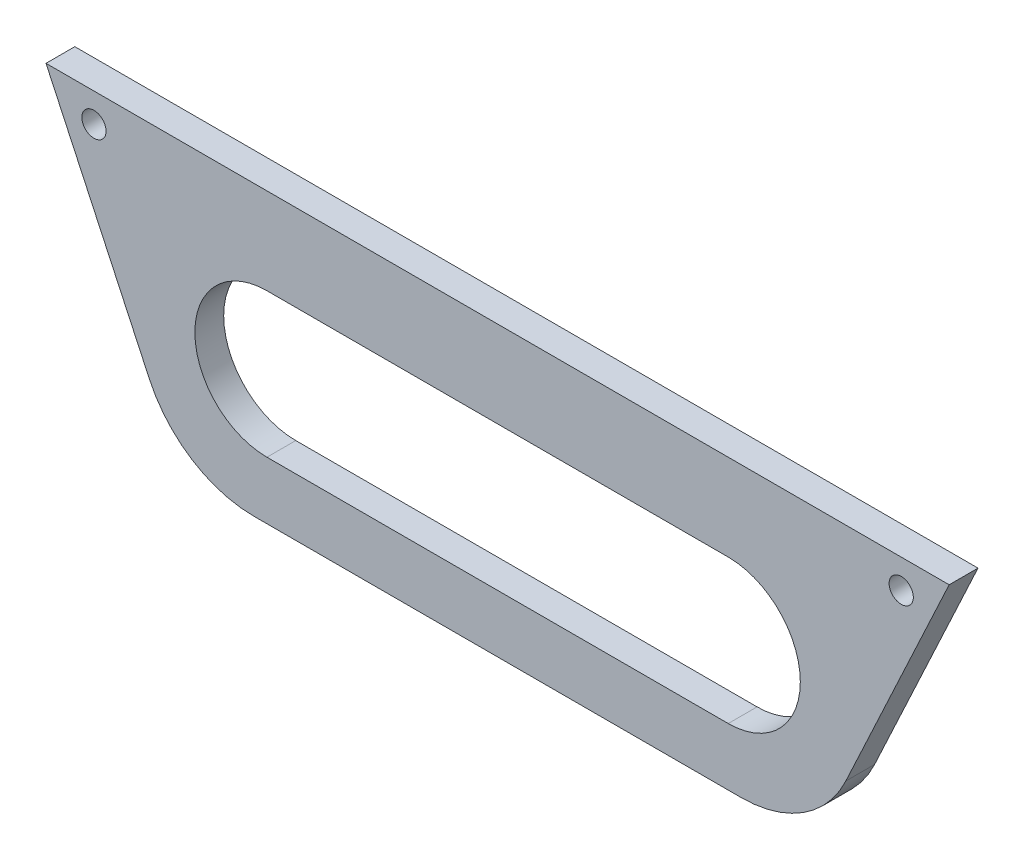
ISO-10303-21;
HEADER;
FILE_DESCRIPTION(('STEP AP214'),'2;1');
FILE_NAME('part.step','',(''),(''),'','','');
FILE_SCHEMA(('AUTOMOTIVE_DESIGN { 1 0 10303 214 1 1 1 1 }'));
ENDSEC;
DATA;
#1=APPLICATION_CONTEXT('core data for automotive mechanical design processes');
#2=APPLICATION_PROTOCOL_DEFINITION('international standard','automotive_design',2000,#1);
#3=PRODUCT_CONTEXT('',#1,'mechanical');
#4=PRODUCT('Part','Part','',(#3));
#5=PRODUCT_RELATED_PRODUCT_CATEGORY('part','',(#4));
#6=PRODUCT_DEFINITION_FORMATION('','',#4);
#7=PRODUCT_DEFINITION_CONTEXT('part definition',#1,'design');
#8=PRODUCT_DEFINITION('design','',#6,#7);
#9=PRODUCT_DEFINITION_SHAPE('','',#8);
#10=(LENGTH_UNIT() NAMED_UNIT(*) SI_UNIT(.MILLI.,.METRE.));
#11=(NAMED_UNIT(*) PLANE_ANGLE_UNIT() SI_UNIT($,.RADIAN.));
#12=(NAMED_UNIT(*) SI_UNIT($,.STERADIAN.) SOLID_ANGLE_UNIT());
#13=UNCERTAINTY_MEASURE_WITH_UNIT(LENGTH_MEASURE(1.E-05),#10,'distance_accuracy_value','');
#14=(GEOMETRIC_REPRESENTATION_CONTEXT(3) GLOBAL_UNCERTAINTY_ASSIGNED_CONTEXT((#13)) GLOBAL_UNIT_ASSIGNED_CONTEXT((#10,
#11,#12)) REPRESENTATION_CONTEXT('',''));
#15=CARTESIAN_POINT('',(0.,0.,0.));
#16=DIRECTION('',(0.,0.,1.));
#17=DIRECTION('',(1.,0.,0.));
#18=AXIS2_PLACEMENT_3D('',#15,#16,#17);
#19=CARTESIAN_POINT('',(36.0567881238971,-29.9999999999945,5.));
#20=DIRECTION('',(0.,0.,1.));
#21=DIRECTION('',(1.,0.,0.));
#22=AXIS2_PLACEMENT_3D('',#19,#20,#21);
#23=PLANE('',#22);
#24=CARTESIAN_POINT('',(148.315382906813,-4.99999999999449,5.));
#25=DIRECTION('',(0.,0.,1.));
#26=DIRECTION('',(1.,0.,0.));
#27=AXIS2_PLACEMENT_3D('',#24,#25,#26);
#28=CIRCLE('',#27,2.10000000000002);
#29=CARTESIAN_POINT('',(150.415382906813,-4.99999999999449,5.));
#30=VERTEX_POINT('',#29);
#31=EDGE_CURVE('E138',#30,#30,#28,.T.);
#32=ORIENTED_EDGE('',*,*,#31,.F.);
#33=EDGE_LOOP('',(#32));
#34=FACE_BOUND('',#33,.T.);
#35=CARTESIAN_POINT('',(36.0567881238971,-29.9999999999945,5.));
#36=DIRECTION('',(0.,0.,1.));
#37=DIRECTION('',(1.,0.,0.));
#38=AXIS2_PLACEMENT_3D('',#35,#36,#37);
#39=CIRCLE('',#38,20.);
#40=CARTESIAN_POINT('',(17.9306323831641,-38.4523652348084,5.));
#41=VERTEX_POINT('',#40);
#42=CARTESIAN_POINT('',(36.0567881238971,-49.9999999999945,5.));
#43=VERTEX_POINT('',#42);
#44=EDGE_CURVE('E148',#41,#43,#39,.T.);
#45=ORIENTED_EDGE('',*,*,#44,.T.);
#46=DIRECTION('',(1.,0.,0.));
#47=VECTOR('',#46,1.);
#48=CARTESIAN_POINT('',(36.0567881238971,-49.9999999999945,5.));
#49=LINE('',#48,#47);
#50=CARTESIAN_POINT('',(120.573977691597,-49.9999999999945,5.));
#51=VERTEX_POINT('',#50);
#52=EDGE_CURVE('E151',#43,#51,#49,.T.);
#53=ORIENTED_EDGE('',*,*,#52,.T.);
#54=CARTESIAN_POINT('',(120.573977691597,-29.9999999999945,5.));
#55=DIRECTION('',(0.,0.,1.));
#56=DIRECTION('',(1.,0.,0.));
#57=AXIS2_PLACEMENT_3D('',#54,#55,#56);
#58=CIRCLE('',#57,20.);
#59=CARTESIAN_POINT('',(138.70013343233,-38.4523652348084,5.));
#60=VERTEX_POINT('',#59);
#61=EDGE_CURVE('E154',#51,#60,#58,.T.);
#62=ORIENTED_EDGE('',*,*,#61,.T.);
#63=DIRECTION('',(0.422618261740698,0.906307787036651,0.));
#64=VECTOR('',#63,1.);
#65=CARTESIAN_POINT('',(138.70013343233,-38.4523652348084,5.));
#66=LINE('',#65,#64);
#67=CARTESIAN_POINT('',(156.630765815494,0.,5.));
#68=VERTEX_POINT('',#67);
#69=EDGE_CURVE('E156',#60,#68,#66,.T.);
#70=ORIENTED_EDGE('',*,*,#69,.T.);
#71=DIRECTION('',(-1.,0.,0.));
#72=VECTOR('',#71,1.);
#73=CARTESIAN_POINT('',(156.630765815494,0.,5.));
#74=LINE('',#73,#72);
#75=CARTESIAN_POINT('',(0.,0.,5.));
#76=VERTEX_POINT('',#75);
#77=EDGE_CURVE('E158',#68,#76,#74,.T.);
#78=ORIENTED_EDGE('',*,*,#77,.T.);
#79=DIRECTION('',(0.422618261740697,-0.906307787036651,0.));
#80=VECTOR('',#79,1.);
#81=CARTESIAN_POINT('',(0.,0.,5.));
#82=LINE('',#81,#80);
#83=EDGE_CURVE('E160',#76,#41,#82,.T.);
#84=ORIENTED_EDGE('',*,*,#83,.T.);
#85=EDGE_LOOP('',(#45,#53,#62,#70,#78,#84));
#86=FACE_BOUND('',#85,.T.);
#87=DIRECTION('',(-1.,0.,0.));
#88=VECTOR('',#87,1.);
#89=CARTESIAN_POINT('',(118.315382907747,-14.9999999999945,5.));
#90=LINE('',#89,#88);
#91=CARTESIAN_POINT('',(118.315382907747,-14.9999999999945,5.));
#92=VERTEX_POINT('',#91);
#93=CARTESIAN_POINT('',(38.3153829077472,-14.9999999999945,5.));
#94=VERTEX_POINT('',#93);
#95=EDGE_CURVE('E117',#92,#94,#90,.T.);
#96=ORIENTED_EDGE('',*,*,#95,.F.);
#97=CARTESIAN_POINT('',(118.315382907747,-27.4999999999945,5.));
#98=DIRECTION('',(0.,0.,1.));
#99=DIRECTION('',(1.,0.,0.));
#100=AXIS2_PLACEMENT_3D('',#97,#98,#99);
#101=CIRCLE('',#100,12.5);
#102=CARTESIAN_POINT('',(118.315382907747,-39.9999999999945,5.));
#103=VERTEX_POINT('',#102);
#104=EDGE_CURVE('E109',#103,#92,#101,.T.);
#105=ORIENTED_EDGE('',*,*,#104,.F.);
#106=DIRECTION('',(1.,0.,0.));
#107=VECTOR('',#106,1.);
#108=CARTESIAN_POINT('',(38.3153829077472,-39.9999999999945,5.));
#109=LINE('',#108,#107);
#110=CARTESIAN_POINT('',(38.3153829077472,-39.9999999999945,5.));
#111=VERTEX_POINT('',#110);
#112=EDGE_CURVE('E132',#111,#103,#109,.T.);
#113=ORIENTED_EDGE('',*,*,#112,.F.);
#114=CARTESIAN_POINT('',(38.3153829077472,-27.4999999999945,5.));
#115=DIRECTION('',(0.,0.,1.));
#116=DIRECTION('',(1.,0.,0.));
#117=AXIS2_PLACEMENT_3D('',#114,#115,#116);
#118=CIRCLE('',#117,12.5);
#119=EDGE_CURVE('E130',#94,#111,#118,.T.);
#120=ORIENTED_EDGE('',*,*,#119,.F.);
#121=EDGE_LOOP('',(#96,#105,#113,#120));
#122=FACE_BOUND('',#121,.T.);
#123=CARTESIAN_POINT('',(8.31538290868039,-4.99999999999449,5.));
#124=DIRECTION('',(0.,0.,1.));
#125=DIRECTION('',(1.,0.,0.));
#126=AXIS2_PLACEMENT_3D('',#123,#124,#125);
#127=CIRCLE('',#126,2.1);
#128=CARTESIAN_POINT('',(10.4153829086804,-4.99999999999449,5.));
#129=VERTEX_POINT('',#128);
#130=EDGE_CURVE('E255',#129,#129,#127,.T.);
#131=ORIENTED_EDGE('',*,*,#130,.F.);
#132=EDGE_LOOP('',(#131));
#133=FACE_BOUND('',#132,.T.);
#134=ADVANCED_FACE('F32',(#34,#86,#122,#133),#23,.T.);
#135=CARTESIAN_POINT('',(36.0567881238971,-29.9999999999945,0.));
#136=DIRECTION('',(0.,0.,1.));
#137=DIRECTION('',(1.,0.,0.));
#138=AXIS2_PLACEMENT_3D('',#135,#136,#137);
#139=PLANE('',#138);
#140=CARTESIAN_POINT('',(148.315382906813,-4.99999999999449,0.));
#141=DIRECTION('',(0.,0.,1.));
#142=DIRECTION('',(1.,0.,0.));
#143=AXIS2_PLACEMENT_3D('',#140,#141,#142);
#144=CIRCLE('',#143,2.10000000000002);
#145=CARTESIAN_POINT('',(150.415382906813,-4.99999999999449,0.));
#146=VERTEX_POINT('',#145);
#147=EDGE_CURVE('E261',#146,#146,#144,.T.);
#148=ORIENTED_EDGE('',*,*,#147,.T.);
#149=EDGE_LOOP('',(#148));
#150=FACE_BOUND('',#149,.T.);
#151=CARTESIAN_POINT('',(36.0567881238971,-29.9999999999945,0.));
#152=DIRECTION('',(0.,0.,1.));
#153=DIRECTION('',(1.,0.,0.));
#154=AXIS2_PLACEMENT_3D('',#151,#152,#153);
#155=CIRCLE('',#154,20.);
#156=CARTESIAN_POINT('',(17.9306323831641,-38.4523652348084,0.));
#157=VERTEX_POINT('',#156);
#158=CARTESIAN_POINT('',(36.0567881238971,-49.9999999999945,0.));
#159=VERTEX_POINT('',#158);
#160=EDGE_CURVE('E125',#157,#159,#155,.T.);
#161=ORIENTED_EDGE('',*,*,#160,.F.);
#162=DIRECTION('',(0.422618261740697,-0.906307787036651,0.));
#163=VECTOR('',#162,1.);
#164=CARTESIAN_POINT('',(0.,0.,0.));
#165=LINE('',#164,#163);
#166=CARTESIAN_POINT('',(0.,0.,0.));
#167=VERTEX_POINT('',#166);
#168=EDGE_CURVE('E152',#167,#157,#165,.T.);
#169=ORIENTED_EDGE('',*,*,#168,.F.);
#170=DIRECTION('',(-1.,0.,0.));
#171=VECTOR('',#170,1.);
#172=CARTESIAN_POINT('',(156.630765815494,0.,0.));
#173=LINE('',#172,#171);
#174=CARTESIAN_POINT('',(156.630765815494,0.,0.));
#175=VERTEX_POINT('',#174);
#176=EDGE_CURVE('E171',#175,#167,#173,.T.);
#177=ORIENTED_EDGE('',*,*,#176,.F.);
#178=DIRECTION('',(0.422618261740698,0.906307787036651,0.));
#179=VECTOR('',#178,1.);
#180=CARTESIAN_POINT('',(138.70013343233,-38.4523652348084,0.));
#181=LINE('',#180,#179);
#182=CARTESIAN_POINT('',(138.70013343233,-38.4523652348084,0.));
#183=VERTEX_POINT('',#182);
#184=EDGE_CURVE('E169',#183,#175,#181,.T.);
#185=ORIENTED_EDGE('',*,*,#184,.F.);
#186=CARTESIAN_POINT('',(120.573977691597,-29.9999999999945,0.));
#187=DIRECTION('',(0.,0.,1.));
#188=DIRECTION('',(1.,0.,0.));
#189=AXIS2_PLACEMENT_3D('',#186,#187,#188);
#190=CIRCLE('',#189,20.);
#191=CARTESIAN_POINT('',(120.573977691597,-49.9999999999945,0.));
#192=VERTEX_POINT('',#191);
#193=EDGE_CURVE('E167',#192,#183,#190,.T.);
#194=ORIENTED_EDGE('',*,*,#193,.F.);
#195=DIRECTION('',(1.,0.,0.));
#196=VECTOR('',#195,1.);
#197=CARTESIAN_POINT('',(36.0567881238971,-49.9999999999945,0.));
#198=LINE('',#197,#196);
#199=EDGE_CURVE('E165',#159,#192,#198,.T.);
#200=ORIENTED_EDGE('',*,*,#199,.F.);
#201=EDGE_LOOP('',(#161,#169,#177,#185,#194,#200));
#202=FACE_BOUND('',#201,.T.);
#203=CARTESIAN_POINT('',(118.315382907747,-27.4999999999945,0.));
#204=DIRECTION('',(0.,0.,1.));
#205=DIRECTION('',(1.,0.,0.));
#206=AXIS2_PLACEMENT_3D('',#203,#204,#205);
#207=CIRCLE('',#206,12.5);
#208=CARTESIAN_POINT('',(118.315382907747,-39.9999999999945,0.));
#209=VERTEX_POINT('',#208);
#210=CARTESIAN_POINT('',(118.315382907747,-14.9999999999945,0.));
#211=VERTEX_POINT('',#210);
#212=EDGE_CURVE('E55',#209,#211,#207,.T.);
#213=ORIENTED_EDGE('',*,*,#212,.T.);
#214=DIRECTION('',(-1.,0.,0.));
#215=VECTOR('',#214,1.);
#216=CARTESIAN_POINT('',(118.315382907747,-14.9999999999945,0.));
#217=LINE('',#216,#215);
#218=CARTESIAN_POINT('',(38.3153829077472,-14.9999999999945,0.));
#219=VERTEX_POINT('',#218);
#220=EDGE_CURVE('E124',#211,#219,#217,.T.);
#221=ORIENTED_EDGE('',*,*,#220,.T.);
#222=CARTESIAN_POINT('',(38.3153829077472,-27.4999999999945,0.));
#223=DIRECTION('',(0.,0.,1.));
#224=DIRECTION('',(1.,0.,0.));
#225=AXIS2_PLACEMENT_3D('',#222,#223,#224);
#226=CIRCLE('',#225,12.5);
#227=CARTESIAN_POINT('',(38.3153829077472,-39.9999999999945,0.));
#228=VERTEX_POINT('',#227);
#229=EDGE_CURVE('E140',#219,#228,#226,.T.);
#230=ORIENTED_EDGE('',*,*,#229,.T.);
#231=DIRECTION('',(1.,0.,0.));
#232=VECTOR('',#231,1.);
#233=CARTESIAN_POINT('',(38.3153829077472,-39.9999999999945,0.));
#234=LINE('',#233,#232);
#235=EDGE_CURVE('E118',#228,#209,#234,.T.);
#236=ORIENTED_EDGE('',*,*,#235,.T.);
#237=EDGE_LOOP('',(#213,#221,#230,#236));
#238=FACE_BOUND('',#237,.T.);
#239=CARTESIAN_POINT('',(8.31538290868039,-4.99999999999449,0.));
#240=DIRECTION('',(0.,0.,1.));
#241=DIRECTION('',(1.,0.,0.));
#242=AXIS2_PLACEMENT_3D('',#239,#240,#241);
#243=CIRCLE('',#242,2.1);
#244=CARTESIAN_POINT('',(10.4153829086804,-4.99999999999449,0.));
#245=VERTEX_POINT('',#244);
#246=EDGE_CURVE('E258',#245,#245,#243,.T.);
#247=ORIENTED_EDGE('',*,*,#246,.T.);
#248=EDGE_LOOP('',(#247));
#249=FACE_BOUND('',#248,.T.);
#250=ADVANCED_FACE('F195',(#150,#202,#238,#249),#139,.F.);
#251=CARTESIAN_POINT('',(36.0567881238971,-29.9999999999945,5.));
#252=DIRECTION('',(0.,0.,-1.));
#253=DIRECTION('',(-1.,0.,0.));
#254=AXIS2_PLACEMENT_3D('',#251,#252,#253);
#255=CYLINDRICAL_SURFACE('',#254,20.);
#256=ORIENTED_EDGE('',*,*,#160,.T.);
#257=DIRECTION('',(0.,0.,-1.));
#258=VECTOR('',#257,1.);
#259=CARTESIAN_POINT('',(36.0567881238971,-49.9999999999945,5.));
#260=LINE('',#259,#258);
#261=EDGE_CURVE('E11',#43,#159,#260,.T.);
#262=ORIENTED_EDGE('',*,*,#261,.F.);
#263=ORIENTED_EDGE('',*,*,#44,.F.);
#264=DIRECTION('',(0.,0.,-1.));
#265=VECTOR('',#264,1.);
#266=CARTESIAN_POINT('',(17.9306323831641,-38.4523652348084,5.));
#267=LINE('',#266,#265);
#268=EDGE_CURVE('E162',#41,#157,#267,.T.);
#269=ORIENTED_EDGE('',*,*,#268,.T.);
#270=EDGE_LOOP('',(#256,#262,#263,#269));
#271=FACE_BOUND('',#270,.T.);
#272=ADVANCED_FACE('F34',(#271),#255,.T.);
#273=CARTESIAN_POINT('',(36.0567881238971,-49.9999999999945,5.));
#274=DIRECTION('',(0.,1.,0.));
#275=DIRECTION('',(0.,0.,1.));
#276=AXIS2_PLACEMENT_3D('',#273,#274,#275);
#277=PLANE('',#276);
#278=ORIENTED_EDGE('',*,*,#199,.T.);
#279=DIRECTION('',(0.,0.,-1.));
#280=VECTOR('',#279,1.);
#281=CARTESIAN_POINT('',(120.573977691597,-49.9999999999945,5.));
#282=LINE('',#281,#280);
#283=EDGE_CURVE('E40',#51,#192,#282,.T.);
#284=ORIENTED_EDGE('',*,*,#283,.F.);
#285=ORIENTED_EDGE('',*,*,#52,.F.);
#286=ORIENTED_EDGE('',*,*,#261,.T.);
#287=EDGE_LOOP('',(#278,#284,#285,#286));
#288=FACE_BOUND('',#287,.T.);
#289=ADVANCED_FACE('F212',(#288),#277,.F.);
#290=CARTESIAN_POINT('',(120.573977691597,-29.9999999999945,5.));
#291=DIRECTION('',(0.,0.,-1.));
#292=DIRECTION('',(-1.,0.,0.));
#293=AXIS2_PLACEMENT_3D('',#290,#291,#292);
#294=CYLINDRICAL_SURFACE('',#293,20.);
#295=ORIENTED_EDGE('',*,*,#193,.T.);
#296=DIRECTION('',(0.,0.,-1.));
#297=VECTOR('',#296,1.);
#298=CARTESIAN_POINT('',(138.70013343233,-38.4523652348084,5.));
#299=LINE('',#298,#297);
#300=EDGE_CURVE('E182',#60,#183,#299,.T.);
#301=ORIENTED_EDGE('',*,*,#300,.F.);
#302=ORIENTED_EDGE('',*,*,#61,.F.);
#303=ORIENTED_EDGE('',*,*,#283,.T.);
#304=EDGE_LOOP('',(#295,#301,#302,#303));
#305=FACE_BOUND('',#304,.T.);
#306=ADVANCED_FACE('F189',(#305),#294,.T.);
#307=CARTESIAN_POINT('',(138.70013343233,-38.4523652348084,5.));
#308=DIRECTION('',(-0.906307787036651,0.422618261740698,0.));
#309=DIRECTION('',(-0.422618261740698,-0.906307787036651,0.));
#310=AXIS2_PLACEMENT_3D('',#307,#308,#309);
#311=PLANE('',#310);
#312=ORIENTED_EDGE('',*,*,#184,.T.);
#313=DIRECTION('',(0.,0.,-1.));
#314=VECTOR('',#313,1.);
#315=CARTESIAN_POINT('',(156.630765815494,0.,5.));
#316=LINE('',#315,#314);
#317=EDGE_CURVE('E179',#68,#175,#316,.T.);
#318=ORIENTED_EDGE('',*,*,#317,.F.);
#319=ORIENTED_EDGE('',*,*,#69,.F.);
#320=ORIENTED_EDGE('',*,*,#300,.T.);
#321=EDGE_LOOP('',(#312,#318,#319,#320));
#322=FACE_BOUND('',#321,.T.);
#323=ADVANCED_FACE('F201',(#322),#311,.F.);
#324=CARTESIAN_POINT('',(156.630765815494,0.,5.));
#325=DIRECTION('',(0.,-1.,0.));
#326=DIRECTION('',(0.,0.,-1.));
#327=AXIS2_PLACEMENT_3D('',#324,#325,#326);
#328=PLANE('',#327);
#329=ORIENTED_EDGE('',*,*,#176,.T.);
#330=DIRECTION('',(0.,0.,-1.));
#331=VECTOR('',#330,1.);
#332=CARTESIAN_POINT('',(0.,0.,5.));
#333=LINE('',#332,#331);
#334=EDGE_CURVE('E176',#76,#167,#333,.T.);
#335=ORIENTED_EDGE('',*,*,#334,.F.);
#336=ORIENTED_EDGE('',*,*,#77,.F.);
#337=ORIENTED_EDGE('',*,*,#317,.T.);
#338=EDGE_LOOP('',(#329,#335,#336,#337));
#339=FACE_BOUND('',#338,.T.);
#340=ADVANCED_FACE('F205',(#339),#328,.F.);
#341=CARTESIAN_POINT('',(0.,0.,5.));
#342=DIRECTION('',(0.906307787036651,0.422618261740697,0.));
#343=DIRECTION('',(-0.422618261740697,0.906307787036651,0.));
#344=AXIS2_PLACEMENT_3D('',#341,#342,#343);
#345=PLANE('',#344);
#346=ORIENTED_EDGE('',*,*,#168,.T.);
#347=ORIENTED_EDGE('',*,*,#268,.F.);
#348=ORIENTED_EDGE('',*,*,#83,.F.);
#349=ORIENTED_EDGE('',*,*,#334,.T.);
#350=EDGE_LOOP('',(#346,#347,#348,#349));
#351=FACE_BOUND('',#350,.T.);
#352=ADVANCED_FACE('F215',(#351),#345,.F.);
#353=CARTESIAN_POINT('',(118.315382907747,-27.4999999999945,5.));
#354=DIRECTION('',(0.,0.,-1.));
#355=DIRECTION('',(-1.,0.,0.));
#356=AXIS2_PLACEMENT_3D('',#353,#354,#355);
#357=CYLINDRICAL_SURFACE('',#356,12.5);
#358=ORIENTED_EDGE('',*,*,#212,.F.);
#359=DIRECTION('',(0.,0.,-1.));
#360=VECTOR('',#359,1.);
#361=CARTESIAN_POINT('',(118.315382907747,-39.9999999999945,5.));
#362=LINE('',#361,#360);
#363=EDGE_CURVE('E113',#103,#209,#362,.T.);
#364=ORIENTED_EDGE('',*,*,#363,.F.);
#365=ORIENTED_EDGE('',*,*,#104,.T.);
#366=DIRECTION('',(0.,0.,-1.));
#367=VECTOR('',#366,1.);
#368=CARTESIAN_POINT('',(118.315382907747,-14.9999999999945,5.));
#369=LINE('',#368,#367);
#370=EDGE_CURVE('E112',#92,#211,#369,.T.);
#371=ORIENTED_EDGE('',*,*,#370,.T.);
#372=EDGE_LOOP('',(#358,#364,#365,#371));
#373=FACE_BOUND('',#372,.T.);
#374=ADVANCED_FACE('F111',(#373),#357,.F.);
#375=CARTESIAN_POINT('',(118.315382907747,-14.9999999999945,5.));
#376=DIRECTION('',(0.,-1.,0.));
#377=DIRECTION('',(0.,0.,-1.));
#378=AXIS2_PLACEMENT_3D('',#375,#376,#377);
#379=PLANE('',#378);
#380=ORIENTED_EDGE('',*,*,#220,.F.);
#381=ORIENTED_EDGE('',*,*,#370,.F.);
#382=ORIENTED_EDGE('',*,*,#95,.T.);
#383=DIRECTION('',(0.,0.,-1.));
#384=VECTOR('',#383,1.);
#385=CARTESIAN_POINT('',(38.3153829077472,-14.9999999999945,5.));
#386=LINE('',#385,#384);
#387=EDGE_CURVE('E126',#94,#219,#386,.T.);
#388=ORIENTED_EDGE('',*,*,#387,.T.);
#389=EDGE_LOOP('',(#380,#381,#382,#388));
#390=FACE_BOUND('',#389,.T.);
#391=ADVANCED_FACE('F121',(#390),#379,.T.);
#392=CARTESIAN_POINT('',(38.3153829077472,-27.4999999999945,5.));
#393=DIRECTION('',(0.,0.,-1.));
#394=DIRECTION('',(-1.,0.,0.));
#395=AXIS2_PLACEMENT_3D('',#392,#393,#394);
#396=CYLINDRICAL_SURFACE('',#395,12.5);
#397=ORIENTED_EDGE('',*,*,#229,.F.);
#398=ORIENTED_EDGE('',*,*,#387,.F.);
#399=ORIENTED_EDGE('',*,*,#119,.T.);
#400=DIRECTION('',(0.,0.,-1.));
#401=VECTOR('',#400,1.);
#402=CARTESIAN_POINT('',(38.3153829077472,-39.9999999999945,5.));
#403=LINE('',#402,#401);
#404=EDGE_CURVE('E47',#111,#228,#403,.T.);
#405=ORIENTED_EDGE('',*,*,#404,.T.);
#406=EDGE_LOOP('',(#397,#398,#399,#405));
#407=FACE_BOUND('',#406,.T.);
#408=ADVANCED_FACE('F236',(#407),#396,.F.);
#409=CARTESIAN_POINT('',(38.3153829077472,-39.9999999999945,5.));
#410=DIRECTION('',(0.,1.,0.));
#411=DIRECTION('',(0.,0.,1.));
#412=AXIS2_PLACEMENT_3D('',#409,#410,#411);
#413=PLANE('',#412);
#414=ORIENTED_EDGE('',*,*,#235,.F.);
#415=ORIENTED_EDGE('',*,*,#404,.F.);
#416=ORIENTED_EDGE('',*,*,#112,.T.);
#417=ORIENTED_EDGE('',*,*,#363,.T.);
#418=EDGE_LOOP('',(#414,#415,#416,#417));
#419=FACE_BOUND('',#418,.T.);
#420=ADVANCED_FACE('F239',(#419),#413,.T.);
#421=CARTESIAN_POINT('',(148.315382906813,-4.99999999999449,5.));
#422=DIRECTION('',(0.,0.,-1.));
#423=DIRECTION('',(-1.,0.,0.));
#424=AXIS2_PLACEMENT_3D('',#421,#422,#423);
#425=CYLINDRICAL_SURFACE('',#424,2.10000000000002);
#426=ORIENTED_EDGE('',*,*,#31,.T.);
#427=EDGE_LOOP('',(#426));
#428=FACE_BOUND('',#427,.T.);
#429=ORIENTED_EDGE('',*,*,#147,.F.);
#430=EDGE_LOOP('',(#429));
#431=FACE_BOUND('',#430,.T.);
#432=ADVANCED_FACE('F243',(#428,#431),#425,.F.);
#433=CARTESIAN_POINT('',(8.31538290868039,-4.99999999999449,5.));
#434=DIRECTION('',(0.,0.,-1.));
#435=DIRECTION('',(-1.,0.,0.));
#436=AXIS2_PLACEMENT_3D('',#433,#434,#435);
#437=CYLINDRICAL_SURFACE('',#436,2.1);
#438=ORIENTED_EDGE('',*,*,#130,.T.);
#439=EDGE_LOOP('',(#438));
#440=FACE_BOUND('',#439,.T.);
#441=ORIENTED_EDGE('',*,*,#246,.F.);
#442=EDGE_LOOP('',(#441));
#443=FACE_BOUND('',#442,.T.);
#444=ADVANCED_FACE('F246',(#440,#443),#437,.F.);
#445=CLOSED_SHELL('',(#134,#250,#272,#289,#306,#323,#340,#352,#374,#391,#408,#420,#432,#444));
#446=MANIFOLD_SOLID_BREP('B2',#445);
#447=ADVANCED_BREP_SHAPE_REPRESENTATION('',(#18,#446),#14);
#448=SHAPE_DEFINITION_REPRESENTATION(#9,#447);
ENDSEC;
END-ISO-10303-21;
